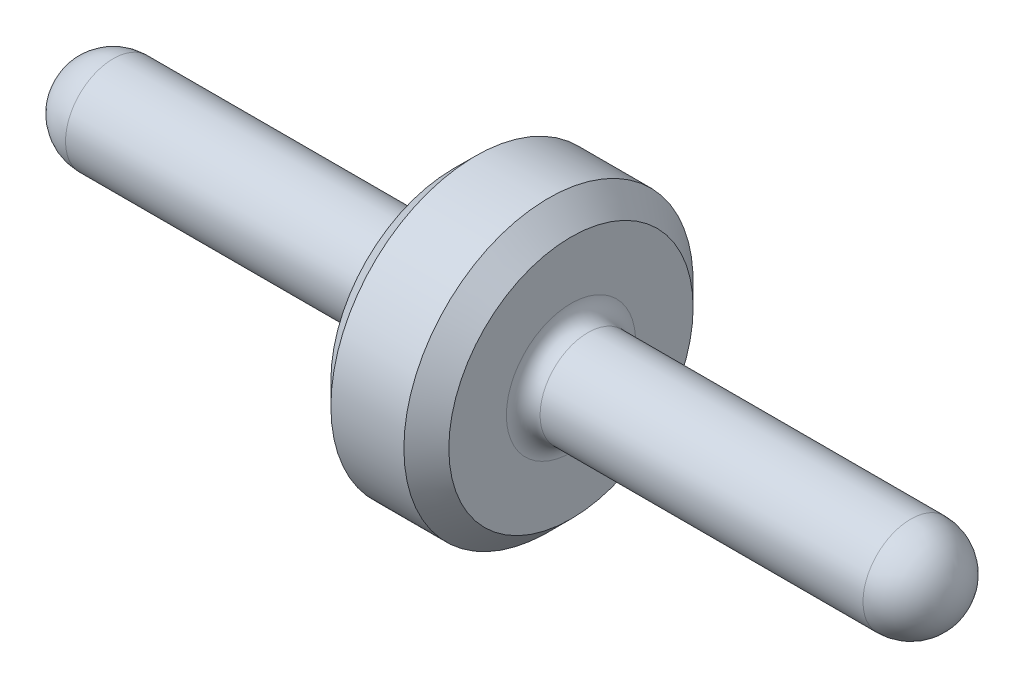
ISO-10303-21;
HEADER;
FILE_DESCRIPTION(('STEP AP214'),'2;1');
FILE_NAME('part.step','',(''),(''),'','','');
FILE_SCHEMA(('AUTOMOTIVE_DESIGN { 1 0 10303 214 1 1 1 1 }'));
ENDSEC;
DATA;
#1=APPLICATION_CONTEXT('core data for automotive mechanical design processes');
#2=APPLICATION_PROTOCOL_DEFINITION('international standard','automotive_design',2000,#1);
#3=PRODUCT_CONTEXT('',#1,'mechanical');
#4=PRODUCT('Part','Part','',(#3));
#5=PRODUCT_RELATED_PRODUCT_CATEGORY('part','',(#4));
#6=PRODUCT_DEFINITION_FORMATION('','',#4);
#7=PRODUCT_DEFINITION_CONTEXT('part definition',#1,'design');
#8=PRODUCT_DEFINITION('design','',#6,#7);
#9=PRODUCT_DEFINITION_SHAPE('','',#8);
#10=(LENGTH_UNIT() NAMED_UNIT(*) SI_UNIT(.MILLI.,.METRE.));
#11=(NAMED_UNIT(*) PLANE_ANGLE_UNIT() SI_UNIT($,.RADIAN.));
#12=(NAMED_UNIT(*) SI_UNIT($,.STERADIAN.) SOLID_ANGLE_UNIT());
#13=UNCERTAINTY_MEASURE_WITH_UNIT(LENGTH_MEASURE(1.E-05),#10,'distance_accuracy_value','');
#14=(GEOMETRIC_REPRESENTATION_CONTEXT(3) GLOBAL_UNCERTAINTY_ASSIGNED_CONTEXT((#13)) GLOBAL_UNIT_ASSIGNED_CONTEXT((#10,
#11,#12)) REPRESENTATION_CONTEXT('',''));
#15=CARTESIAN_POINT('',(0.,0.,0.));
#16=DIRECTION('',(0.,0.,1.));
#17=DIRECTION('',(1.,0.,0.));
#18=AXIS2_PLACEMENT_3D('',#15,#16,#17);
#19=CARTESIAN_POINT('',(1.67640000000001,0.,0.));
#20=DIRECTION('',(-1.,0.,0.));
#21=DIRECTION('',(0.,0.,1.));
#22=AXIS2_PLACEMENT_3D('',#19,#20,#21);
#23=TOROIDAL_SURFACE('',#22,0.29209999999999,0.0761999999999985);
#24=CARTESIAN_POINT('',(1.67640000000001,0.,0.));
#25=DIRECTION('',(-1.,0.,0.));
#26=DIRECTION('',(0.,0.,1.));
#27=AXIS2_PLACEMENT_3D('',#24,#25,#26);
#28=CIRCLE('',#27,0.215899999999991);
#29=CARTESIAN_POINT('',(1.67640000000001,0.,0.215899999999991));
#30=VERTEX_POINT('',#29);
#31=EDGE_CURVE('E10',#30,#30,#28,.T.);
#32=ORIENTED_EDGE('',*,*,#31,.F.);
#33=EDGE_LOOP('',(#32));
#34=FACE_BOUND('',#33,.T.);
#35=CARTESIAN_POINT('',(1.75260000000001,0.,0.));
#36=DIRECTION('',(-1.,0.,0.));
#37=DIRECTION('',(0.,0.,1.));
#38=AXIS2_PLACEMENT_3D('',#35,#36,#37);
#39=CIRCLE('',#38,0.29209999999999);
#40=CARTESIAN_POINT('',(1.75260000000001,0.,0.29209999999999));
#41=VERTEX_POINT('',#40);
#42=EDGE_CURVE('E67',#41,#41,#39,.T.);
#43=ORIENTED_EDGE('',*,*,#42,.T.);
#44=EDGE_LOOP('',(#43));
#45=FACE_BOUND('',#44,.T.);
#46=ADVANCED_FACE('F33',(#34,#45),#23,.F.);
#47=CARTESIAN_POINT('',(0.,0.,0.));
#48=DIRECTION('',(-1.,0.,0.));
#49=DIRECTION('',(0.,0.,1.));
#50=AXIS2_PLACEMENT_3D('',#47,#48,#49);
#51=CYLINDRICAL_SURFACE('',#50,0.215899999999991);
#52=CARTESIAN_POINT('',(0.215900000000005,0.,0.));
#53=DIRECTION('',(-1.,0.,0.));
#54=DIRECTION('',(0.,0.,1.));
#55=AXIS2_PLACEMENT_3D('',#52,#53,#54);
#56=CIRCLE('',#55,0.215899999999991);
#57=CARTESIAN_POINT('',(0.215900000000005,0.,0.215899999999991));
#58=VERTEX_POINT('',#57);
#59=EDGE_CURVE('E39',#58,#58,#56,.T.);
#60=ORIENTED_EDGE('',*,*,#59,.F.);
#61=EDGE_LOOP('',(#60));
#62=FACE_BOUND('',#61,.T.);
#63=ORIENTED_EDGE('',*,*,#31,.T.);
#64=EDGE_LOOP('',(#63));
#65=FACE_BOUND('',#64,.T.);
#66=ADVANCED_FACE('F121',(#62,#65),#51,.T.);
#67=CARTESIAN_POINT('',(0.215900000000005,0.,0.));
#68=DIRECTION('',(-1.,0.,0.));
#69=DIRECTION('',(0.,1.,0.));
#70=AXIS2_PLACEMENT_3D('',#67,#68,#69);
#71=SPHERICAL_SURFACE('',#70,0.215899999999998);
#72=ORIENTED_EDGE('',*,*,#59,.T.);
#73=EDGE_LOOP('',(#72));
#74=FACE_BOUND('',#73,.T.);
#75=ADVANCED_FACE('F116',(#74),#71,.T.);
#76=CARTESIAN_POINT('',(3.82270000000004,0.,0.));
#77=DIRECTION('',(-1.,0.,0.));
#78=DIRECTION('',(0.,1.,0.));
#79=AXIS2_PLACEMENT_3D('',#76,#77,#78);
#80=SPHERICAL_SURFACE('',#79,0.215899999999991);
#81=CARTESIAN_POINT('',(3.82270000000004,0.,0.));
#82=DIRECTION('',(-1.,0.,0.));
#83=DIRECTION('',(0.,0.,1.));
#84=AXIS2_PLACEMENT_3D('',#81,#82,#83);
#85=CIRCLE('',#84,0.215899999999991);
#86=CARTESIAN_POINT('',(3.82270000000004,0.,0.215899999999991));
#87=VERTEX_POINT('',#86);
#88=EDGE_CURVE('E43',#87,#87,#85,.T.);
#89=ORIENTED_EDGE('',*,*,#88,.F.);
#90=EDGE_LOOP('',(#89));
#91=FACE_BOUND('',#90,.T.);
#92=ADVANCED_FACE('F111',(#91),#80,.T.);
#93=CARTESIAN_POINT('',(0.,0.,0.));
#94=DIRECTION('',(-1.,0.,0.));
#95=DIRECTION('',(0.,0.,1.));
#96=AXIS2_PLACEMENT_3D('',#93,#94,#95);
#97=CYLINDRICAL_SURFACE('',#96,0.215899999999991);
#98=CARTESIAN_POINT('',(2.36220000000004,0.,0.));
#99=DIRECTION('',(-1.,0.,0.));
#100=DIRECTION('',(0.,0.,1.));
#101=AXIS2_PLACEMENT_3D('',#98,#99,#100);
#102=CIRCLE('',#101,0.215899999999991);
#103=CARTESIAN_POINT('',(2.36220000000004,0.,0.215899999999991));
#104=VERTEX_POINT('',#103);
#105=EDGE_CURVE('E47',#104,#104,#102,.T.);
#106=ORIENTED_EDGE('',*,*,#105,.F.);
#107=EDGE_LOOP('',(#106));
#108=FACE_BOUND('',#107,.T.);
#109=ORIENTED_EDGE('',*,*,#88,.T.);
#110=EDGE_LOOP('',(#109));
#111=FACE_BOUND('',#110,.T.);
#112=ADVANCED_FACE('F105',(#108,#111),#97,.T.);
#113=CARTESIAN_POINT('',(2.36220000000004,0.,0.));
#114=DIRECTION('',(-1.,0.,0.));
#115=DIRECTION('',(0.,0.,1.));
#116=AXIS2_PLACEMENT_3D('',#113,#114,#115);
#117=TOROIDAL_SURFACE('',#116,0.29209999999999,0.0761999999999985);
#118=CARTESIAN_POINT('',(2.28600000000004,0.,0.));
#119=DIRECTION('',(-1.,0.,0.));
#120=DIRECTION('',(0.,0.,1.));
#121=AXIS2_PLACEMENT_3D('',#118,#119,#120);
#122=CIRCLE('',#121,0.29209999999999);
#123=CARTESIAN_POINT('',(2.28600000000004,0.,0.29209999999999));
#124=VERTEX_POINT('',#123);
#125=EDGE_CURVE('E52',#124,#124,#122,.T.);
#126=ORIENTED_EDGE('',*,*,#125,.F.);
#127=EDGE_LOOP('',(#126));
#128=FACE_BOUND('',#127,.T.);
#129=ORIENTED_EDGE('',*,*,#105,.T.);
#130=EDGE_LOOP('',(#129));
#131=FACE_BOUND('',#130,.T.);
#132=ADVANCED_FACE('F99',(#128,#131),#117,.F.);
#133=CARTESIAN_POINT('',(2.28600000000002,0.29209999999999,0.));
#134=DIRECTION('',(-1.,0.,0.));
#135=DIRECTION('',(0.,0.,1.));
#136=AXIS2_PLACEMENT_3D('',#133,#134,#135);
#137=PLANE('',#136);
#138=CARTESIAN_POINT('',(2.286,0.,0.));
#139=DIRECTION('',(-1.,0.,0.));
#140=DIRECTION('',(0.,0.,1.));
#141=AXIS2_PLACEMENT_3D('',#138,#139,#140);
#142=CIRCLE('',#141,0.55245000000001);
#143=CARTESIAN_POINT('',(2.286,0.,0.55245000000001));
#144=VERTEX_POINT('',#143);
#145=EDGE_CURVE('E55',#144,#144,#142,.T.);
#146=ORIENTED_EDGE('',*,*,#145,.F.);
#147=EDGE_LOOP('',(#146));
#148=FACE_BOUND('',#147,.T.);
#149=ORIENTED_EDGE('',*,*,#125,.T.);
#150=EDGE_LOOP('',(#149));
#151=FACE_BOUND('',#150,.T.);
#152=ADVANCED_FACE('F93',(#148,#151),#137,.F.);
#153=CARTESIAN_POINT('',(2.286,0.,0.));
#154=DIRECTION('',(-1.,0.,0.));
#155=DIRECTION('',(0.,0.,1.));
#156=AXIS2_PLACEMENT_3D('',#153,#154,#155);
#157=CONICAL_SURFACE('',#156,0.55245000000001,0.785398163397584);
#158=CARTESIAN_POINT('',(2.18440000000004,0.,0.));
#159=DIRECTION('',(-1.,0.,0.));
#160=DIRECTION('',(0.,0.,1.));
#161=AXIS2_PLACEMENT_3D('',#158,#159,#160);
#162=CIRCLE('',#161,0.654049999999989);
#163=CARTESIAN_POINT('',(2.18440000000004,0.,0.654049999999989));
#164=VERTEX_POINT('',#163);
#165=EDGE_CURVE('E58',#164,#164,#162,.T.);
#166=ORIENTED_EDGE('',*,*,#165,.F.);
#167=EDGE_LOOP('',(#166));
#168=FACE_BOUND('',#167,.T.);
#169=ORIENTED_EDGE('',*,*,#145,.T.);
#170=EDGE_LOOP('',(#169));
#171=FACE_BOUND('',#170,.T.);
#172=ADVANCED_FACE('F87',(#168,#171),#157,.T.);
#173=CARTESIAN_POINT('',(0.,0.,0.));
#174=DIRECTION('',(-1.,0.,0.));
#175=DIRECTION('',(0.,0.,1.));
#176=AXIS2_PLACEMENT_3D('',#173,#174,#175);
#177=CYLINDRICAL_SURFACE('',#176,0.654049999999989);
#178=CARTESIAN_POINT('',(1.85420000000001,0.,0.));
#179=DIRECTION('',(-1.,0.,0.));
#180=DIRECTION('',(0.,0.,1.));
#181=AXIS2_PLACEMENT_3D('',#178,#179,#180);
#182=CIRCLE('',#181,0.654049999999989);
#183=CARTESIAN_POINT('',(1.85420000000001,0.,0.654049999999989));
#184=VERTEX_POINT('',#183);
#185=EDGE_CURVE('E61',#184,#184,#182,.T.);
#186=ORIENTED_EDGE('',*,*,#185,.F.);
#187=EDGE_LOOP('',(#186));
#188=FACE_BOUND('',#187,.T.);
#189=ORIENTED_EDGE('',*,*,#165,.T.);
#190=EDGE_LOOP('',(#189));
#191=FACE_BOUND('',#190,.T.);
#192=ADVANCED_FACE('F81',(#188,#191),#177,.T.);
#193=CARTESIAN_POINT('',(1.85420000000001,0.,0.));
#194=DIRECTION('',(1.,0.,0.));
#195=DIRECTION('',(0.,0.,-1.));
#196=AXIS2_PLACEMENT_3D('',#193,#194,#195);
#197=CONICAL_SURFACE('',#196,0.654049999999989,0.785398163397448);
#198=CARTESIAN_POINT('',(1.75260000000001,0.,0.));
#199=DIRECTION('',(-1.,0.,0.));
#200=DIRECTION('',(0.,0.,1.));
#201=AXIS2_PLACEMENT_3D('',#198,#199,#200);
#202=CIRCLE('',#201,0.552449999999982);
#203=CARTESIAN_POINT('',(1.75260000000001,0.,0.552449999999982));
#204=VERTEX_POINT('',#203);
#205=EDGE_CURVE('E64',#204,#204,#202,.T.);
#206=ORIENTED_EDGE('',*,*,#205,.F.);
#207=EDGE_LOOP('',(#206));
#208=FACE_BOUND('',#207,.T.);
#209=ORIENTED_EDGE('',*,*,#185,.T.);
#210=EDGE_LOOP('',(#209));
#211=FACE_BOUND('',#210,.T.);
#212=ADVANCED_FACE('F75',(#208,#211),#197,.T.);
#213=CARTESIAN_POINT('',(1.75260000000001,0.29209999999999,0.));
#214=DIRECTION('',(1.,0.,0.));
#215=DIRECTION('',(0.,0.,-1.));
#216=AXIS2_PLACEMENT_3D('',#213,#214,#215);
#217=PLANE('',#216);
#218=ORIENTED_EDGE('',*,*,#42,.F.);
#219=EDGE_LOOP('',(#218));
#220=FACE_BOUND('',#219,.T.);
#221=ORIENTED_EDGE('',*,*,#205,.T.);
#222=EDGE_LOOP('',(#221));
#223=FACE_BOUND('',#222,.T.);
#224=ADVANCED_FACE('F72',(#220,#223),#217,.F.);
#225=CLOSED_SHELL('',(#46,#66,#75,#92,#112,#132,#152,#172,#192,#212,#224));
#226=MANIFOLD_SOLID_BREP('B2',#225);
#227=ADVANCED_BREP_SHAPE_REPRESENTATION('',(#18,#226),#14);
#228=SHAPE_DEFINITION_REPRESENTATION(#9,#227);
ENDSEC;
END-ISO-10303-21;
